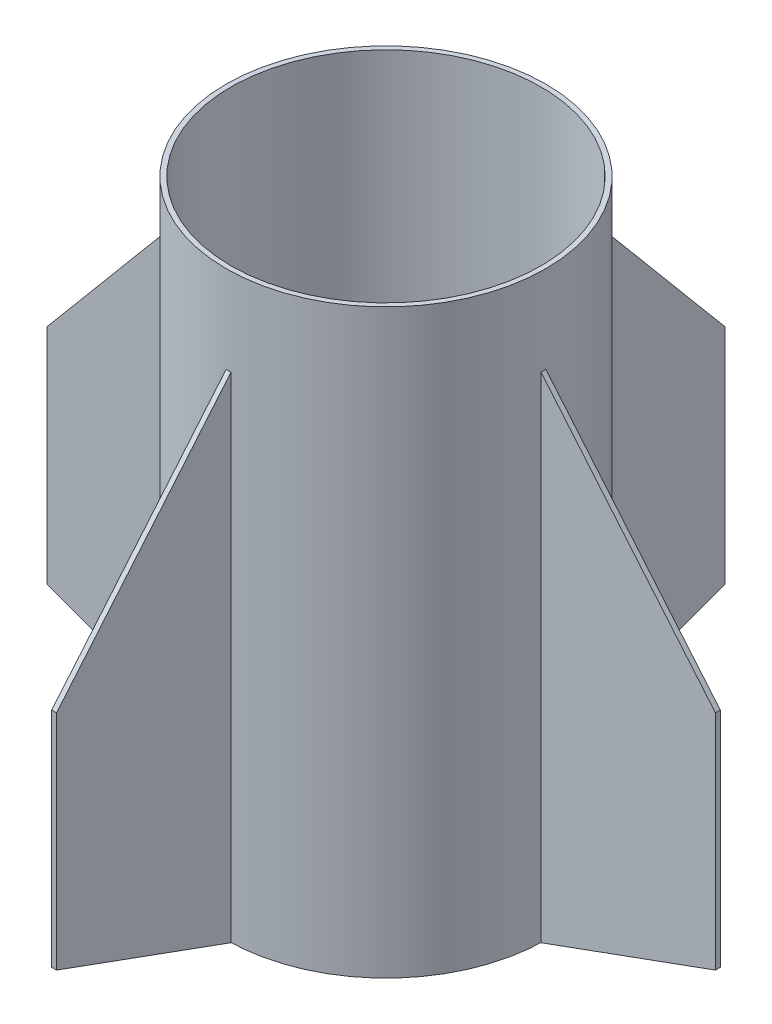
ISO-10303-21;
HEADER;
FILE_DESCRIPTION(('STEP AP214'),'2;1');
FILE_NAME('part.step','',(''),(''),'','','');
FILE_SCHEMA(('AUTOMOTIVE_DESIGN { 1 0 10303 214 1 1 1 1 }'));
ENDSEC;
DATA;
#1=APPLICATION_CONTEXT('core data for automotive mechanical design processes');
#2=APPLICATION_PROTOCOL_DEFINITION('international standard','automotive_design',2000,#1);
#3=PRODUCT_CONTEXT('',#1,'mechanical');
#4=PRODUCT('Part','Part','',(#3));
#5=PRODUCT_RELATED_PRODUCT_CATEGORY('part','',(#4));
#6=PRODUCT_DEFINITION_FORMATION('','',#4);
#7=PRODUCT_DEFINITION_CONTEXT('part definition',#1,'design');
#8=PRODUCT_DEFINITION('design','',#6,#7);
#9=PRODUCT_DEFINITION_SHAPE('','',#8);
#10=(LENGTH_UNIT() NAMED_UNIT(*) SI_UNIT(.MILLI.,.METRE.));
#11=(NAMED_UNIT(*) PLANE_ANGLE_UNIT() SI_UNIT($,.RADIAN.));
#12=(NAMED_UNIT(*) SI_UNIT($,.STERADIAN.) SOLID_ANGLE_UNIT());
#13=UNCERTAINTY_MEASURE_WITH_UNIT(LENGTH_MEASURE(1.E-05),#10,'distance_accuracy_value','');
#14=(GEOMETRIC_REPRESENTATION_CONTEXT(3) GLOBAL_UNCERTAINTY_ASSIGNED_CONTEXT((#13)) GLOBAL_UNIT_ASSIGNED_CONTEXT((#10,
#11,#12)) REPRESENTATION_CONTEXT('',''));
#15=CARTESIAN_POINT('',(0.,0.,0.));
#16=DIRECTION('',(0.,0.,1.));
#17=DIRECTION('',(1.,0.,0.));
#18=AXIS2_PLACEMENT_3D('',#15,#16,#17);
#19=CARTESIAN_POINT('',(104.775,0.,3.175));
#20=DIRECTION('',(1.,0.,0.));
#21=DIRECTION('',(0.,0.,-1.));
#22=AXIS2_PLACEMENT_3D('',#19,#20,#21);
#23=PLANE('',#22);
#24=DIRECTION('',(0.,-1.,0.));
#25=VECTOR('',#24,1.);
#26=CARTESIAN_POINT('',(104.775,0.,0.));
#27=LINE('',#26,#25);
#28=CARTESIAN_POINT('',(104.775,323.85,0.));
#29=VERTEX_POINT('',#28);
#30=CARTESIAN_POINT('',(104.775,0.,0.));
#31=VERTEX_POINT('',#30);
#32=EDGE_CURVE('E107',#29,#31,#27,.T.);
#33=ORIENTED_EDGE('',*,*,#32,.T.);
#34=DIRECTION('',(0.,0.,-1.));
#35=VECTOR('',#34,1.);
#36=CARTESIAN_POINT('',(104.775,0.,3.175));
#37=LINE('',#36,#35);
#38=CARTESIAN_POINT('',(104.775,0.,3.175));
#39=VERTEX_POINT('',#38);
#40=EDGE_CURVE('E12',#39,#31,#37,.T.);
#41=ORIENTED_EDGE('',*,*,#40,.F.);
#42=DIRECTION('',(0.,-1.,0.));
#43=VECTOR('',#42,1.);
#44=CARTESIAN_POINT('',(104.775,0.,3.175));
#45=LINE('',#44,#43);
#46=CARTESIAN_POINT('',(104.775,323.85,3.175));
#47=VERTEX_POINT('',#46);
#48=EDGE_CURVE('E95',#47,#39,#45,.T.);
#49=ORIENTED_EDGE('',*,*,#48,.F.);
#50=DIRECTION('',(0.,0.,-1.));
#51=VECTOR('',#50,1.);
#52=CARTESIAN_POINT('',(104.775,323.85,3.175));
#53=LINE('',#52,#51);
#54=EDGE_CURVE('E103',#47,#29,#53,.T.);
#55=ORIENTED_EDGE('',*,*,#54,.T.);
#56=EDGE_LOOP('',(#33,#41,#49,#55));
#57=FACE_BOUND('',#56,.T.);
#58=ADVANCED_FACE('F44',(#57),#23,.F.);
#59=CARTESIAN_POINT('',(219.075,41.6076727565022,3.175));
#60=DIRECTION('',(-0.342062792128057,0.939677096795254,0.));
#61=DIRECTION('',(-0.939677096795254,-0.342062792128057,0.));
#62=AXIS2_PLACEMENT_3D('',#59,#60,#61);
#63=PLANE('',#62);
#64=DIRECTION('',(0.939677096795254,0.342062792128057,0.));
#65=VECTOR('',#64,1.);
#66=CARTESIAN_POINT('',(219.075,41.6076727565022,0.));
#67=LINE('',#66,#65);
#68=CARTESIAN_POINT('',(219.075,41.6076727565022,0.));
#69=VERTEX_POINT('',#68);
#70=EDGE_CURVE('E99',#31,#69,#67,.T.);
#71=ORIENTED_EDGE('',*,*,#70,.T.);
#72=DIRECTION('',(0.,0.,-1.));
#73=VECTOR('',#72,1.);
#74=CARTESIAN_POINT('',(219.075,41.6076727565022,3.175));
#75=LINE('',#74,#73);
#76=CARTESIAN_POINT('',(219.075,41.6076727565022,3.175));
#77=VERTEX_POINT('',#76);
#78=EDGE_CURVE('E52',#77,#69,#75,.T.);
#79=ORIENTED_EDGE('',*,*,#78,.F.);
#80=DIRECTION('',(0.939677096795254,0.342062792128057,0.));
#81=VECTOR('',#80,1.);
#82=CARTESIAN_POINT('',(219.075,41.6076727565022,3.175));
#83=LINE('',#82,#81);
#84=EDGE_CURVE('E90',#39,#77,#83,.T.);
#85=ORIENTED_EDGE('',*,*,#84,.F.);
#86=ORIENTED_EDGE('',*,*,#40,.T.);
#87=EDGE_LOOP('',(#71,#79,#85,#86));
#88=FACE_BOUND('',#87,.T.);
#89=ADVANCED_FACE('F98',(#88),#63,.F.);
#90=CARTESIAN_POINT('',(219.075,187.657672756502,3.175));
#91=DIRECTION('',(-1.,0.,0.));
#92=DIRECTION('',(0.,-1.,0.));
#93=AXIS2_PLACEMENT_3D('',#90,#91,#92);
#94=PLANE('',#93);
#95=DIRECTION('',(0.,1.,0.));
#96=VECTOR('',#95,1.);
#97=CARTESIAN_POINT('',(219.075,187.657672756502,0.));
#98=LINE('',#97,#96);
#99=CARTESIAN_POINT('',(219.075,187.657672756502,0.));
#100=VERTEX_POINT('',#99);
#101=EDGE_CURVE('E77',#69,#100,#98,.T.);
#102=ORIENTED_EDGE('',*,*,#101,.T.);
#103=DIRECTION('',(0.,0.,-1.));
#104=VECTOR('',#103,1.);
#105=CARTESIAN_POINT('',(219.075,187.657672756502,3.175));
#106=LINE('',#105,#104);
#107=CARTESIAN_POINT('',(219.075,187.657672756502,3.175));
#108=VERTEX_POINT('',#107);
#109=EDGE_CURVE('E100',#108,#100,#106,.T.);
#110=ORIENTED_EDGE('',*,*,#109,.F.);
#111=DIRECTION('',(0.,1.,0.));
#112=VECTOR('',#111,1.);
#113=CARTESIAN_POINT('',(219.075,187.657672756502,3.175));
#114=LINE('',#113,#112);
#115=EDGE_CURVE('E93',#77,#108,#114,.T.);
#116=ORIENTED_EDGE('',*,*,#115,.F.);
#117=ORIENTED_EDGE('',*,*,#78,.T.);
#118=EDGE_LOOP('',(#102,#110,#116,#117));
#119=FACE_BOUND('',#118,.T.);
#120=ADVANCED_FACE('F101',(#119),#94,.F.);
#121=CARTESIAN_POINT('',(104.775,323.85,3.175));
#122=DIRECTION('',(-0.765986092483115,-0.642857142857143,0.));
#123=DIRECTION('',(0.642857142857143,-0.765986092483115,0.));
#124=AXIS2_PLACEMENT_3D('',#121,#122,#123);
#125=PLANE('',#124);
#126=DIRECTION('',(-0.642857142857143,0.765986092483115,0.));
#127=VECTOR('',#126,1.);
#128=CARTESIAN_POINT('',(104.775,323.85,0.));
#129=LINE('',#128,#127);
#130=EDGE_CURVE('E83',#100,#29,#129,.T.);
#131=ORIENTED_EDGE('',*,*,#130,.T.);
#132=ORIENTED_EDGE('',*,*,#54,.F.);
#133=DIRECTION('',(-0.642857142857143,0.765986092483115,0.));
#134=VECTOR('',#133,1.);
#135=CARTESIAN_POINT('',(104.775,323.85,3.175));
#136=LINE('',#135,#134);
#137=EDGE_CURVE('E60',#108,#47,#136,.T.);
#138=ORIENTED_EDGE('',*,*,#137,.F.);
#139=ORIENTED_EDGE('',*,*,#109,.T.);
#140=EDGE_LOOP('',(#131,#132,#138,#139));
#141=FACE_BOUND('',#140,.T.);
#142=ADVANCED_FACE('F114',(#141),#125,.F.);
#143=CARTESIAN_POINT('',(0.,0.,3.175));
#144=DIRECTION('',(0.,0.,1.));
#145=DIRECTION('',(1.,0.,0.));
#146=AXIS2_PLACEMENT_3D('',#143,#144,#145);
#147=PLANE('',#146);
#148=ORIENTED_EDGE('',*,*,#48,.T.);
#149=ORIENTED_EDGE('',*,*,#84,.T.);
#150=ORIENTED_EDGE('',*,*,#115,.T.);
#151=ORIENTED_EDGE('',*,*,#137,.T.);
#152=EDGE_LOOP('',(#148,#149,#150,#151));
#153=FACE_BOUND('',#152,.T.);
#154=ADVANCED_FACE('F91',(#153),#147,.T.);
#155=CARTESIAN_POINT('',(0.,0.,0.));
#156=DIRECTION('',(0.,0.,1.));
#157=DIRECTION('',(1.,0.,0.));
#158=AXIS2_PLACEMENT_3D('',#155,#156,#157);
#159=PLANE('',#158);
#160=ORIENTED_EDGE('',*,*,#32,.F.);
#161=ORIENTED_EDGE('',*,*,#130,.F.);
#162=ORIENTED_EDGE('',*,*,#101,.F.);
#163=ORIENTED_EDGE('',*,*,#70,.F.);
#164=EDGE_LOOP('',(#160,#161,#162,#163));
#165=FACE_BOUND('',#164,.T.);
#166=ADVANCED_FACE('F117',(#165),#159,.F.);
#167=CLOSED_SHELL('',(#58,#89,#120,#142,#154,#166));
#168=MANIFOLD_SOLID_BREP('B2',#167);
#169=CARTESIAN_POINT('',(-104.775,323.85,3.175));
#170=DIRECTION('',(-1.,0.,0.));
#171=DIRECTION('',(0.,0.,1.));
#172=AXIS2_PLACEMENT_3D('',#169,#170,#171);
#173=PLANE('',#172);
#174=DIRECTION('',(0.,1.,0.));
#175=VECTOR('',#174,1.);
#176=CARTESIAN_POINT('',(-104.775,323.85,0.));
#177=LINE('',#176,#175);
#178=CARTESIAN_POINT('',(-104.775,0.,0.));
#179=VERTEX_POINT('',#178);
#180=CARTESIAN_POINT('',(-104.775,323.85,0.));
#181=VERTEX_POINT('',#180);
#182=EDGE_CURVE('E241',#179,#181,#177,.T.);
#183=ORIENTED_EDGE('',*,*,#182,.T.);
#184=DIRECTION('',(0.,0.,-1.));
#185=VECTOR('',#184,1.);
#186=CARTESIAN_POINT('',(-104.775,323.85,3.175));
#187=LINE('',#186,#185);
#188=CARTESIAN_POINT('',(-104.775,323.85,3.175));
#189=VERTEX_POINT('',#188);
#190=EDGE_CURVE('E42',#189,#181,#187,.T.);
#191=ORIENTED_EDGE('',*,*,#190,.F.);
#192=DIRECTION('',(0.,1.,0.));
#193=VECTOR('',#192,1.);
#194=CARTESIAN_POINT('',(-104.775,323.85,3.175));
#195=LINE('',#194,#193);
#196=CARTESIAN_POINT('',(-104.775,0.,3.175));
#197=VERTEX_POINT('',#196);
#198=EDGE_CURVE('E229',#197,#189,#195,.T.);
#199=ORIENTED_EDGE('',*,*,#198,.F.);
#200=DIRECTION('',(0.,0.,-1.));
#201=VECTOR('',#200,1.);
#202=CARTESIAN_POINT('',(-104.775,0.,3.175));
#203=LINE('',#202,#201);
#204=EDGE_CURVE('E237',#197,#179,#203,.T.);
#205=ORIENTED_EDGE('',*,*,#204,.T.);
#206=EDGE_LOOP('',(#183,#191,#199,#205));
#207=FACE_BOUND('',#206,.T.);
#208=ADVANCED_FACE('F178',(#207),#173,.F.);
#209=CARTESIAN_POINT('',(-104.775,323.85,3.175));
#210=DIRECTION('',(0.765986092483115,-0.642857142857143,0.));
#211=DIRECTION('',(0.642857142857143,0.765986092483115,0.));
#212=AXIS2_PLACEMENT_3D('',#209,#210,#211);
#213=PLANE('',#212);
#214=DIRECTION('',(-0.642857142857143,-0.765986092483115,0.));
#215=VECTOR('',#214,1.);
#216=CARTESIAN_POINT('',(-104.775,323.85,0.));
#217=LINE('',#216,#215);
#218=CARTESIAN_POINT('',(-219.075,187.657672756502,0.));
#219=VERTEX_POINT('',#218);
#220=EDGE_CURVE('E233',#181,#219,#217,.T.);
#221=ORIENTED_EDGE('',*,*,#220,.T.);
#222=DIRECTION('',(0.,0.,-1.));
#223=VECTOR('',#222,1.);
#224=CARTESIAN_POINT('',(-219.075,187.657672756502,3.175));
#225=LINE('',#224,#223);
#226=CARTESIAN_POINT('',(-219.075,187.657672756502,3.175));
#227=VERTEX_POINT('',#226);
#228=EDGE_CURVE('E186',#227,#219,#225,.T.);
#229=ORIENTED_EDGE('',*,*,#228,.F.);
#230=DIRECTION('',(-0.642857142857143,-0.765986092483115,0.));
#231=VECTOR('',#230,1.);
#232=CARTESIAN_POINT('',(-104.775,323.85,3.175));
#233=LINE('',#232,#231);
#234=EDGE_CURVE('E224',#189,#227,#233,.T.);
#235=ORIENTED_EDGE('',*,*,#234,.F.);
#236=ORIENTED_EDGE('',*,*,#190,.T.);
#237=EDGE_LOOP('',(#221,#229,#235,#236));
#238=FACE_BOUND('',#237,.T.);
#239=ADVANCED_FACE('F232',(#238),#213,.F.);
#240=CARTESIAN_POINT('',(-219.075,187.657672756502,3.175));
#241=DIRECTION('',(1.,0.,0.));
#242=DIRECTION('',(0.,1.,0.));
#243=AXIS2_PLACEMENT_3D('',#240,#241,#242);
#244=PLANE('',#243);
#245=DIRECTION('',(0.,-1.,0.));
#246=VECTOR('',#245,1.);
#247=CARTESIAN_POINT('',(-219.075,187.657672756502,0.));
#248=LINE('',#247,#246);
#249=CARTESIAN_POINT('',(-219.075,41.6076727565021,0.));
#250=VERTEX_POINT('',#249);
#251=EDGE_CURVE('E211',#219,#250,#248,.T.);
#252=ORIENTED_EDGE('',*,*,#251,.T.);
#253=DIRECTION('',(0.,0.,-1.));
#254=VECTOR('',#253,1.);
#255=CARTESIAN_POINT('',(-219.075,41.6076727565021,3.175));
#256=LINE('',#255,#254);
#257=CARTESIAN_POINT('',(-219.075,41.6076727565021,3.175));
#258=VERTEX_POINT('',#257);
#259=EDGE_CURVE('E234',#258,#250,#256,.T.);
#260=ORIENTED_EDGE('',*,*,#259,.F.);
#261=DIRECTION('',(0.,-1.,0.));
#262=VECTOR('',#261,1.);
#263=CARTESIAN_POINT('',(-219.075,187.657672756502,3.175));
#264=LINE('',#263,#262);
#265=EDGE_CURVE('E227',#227,#258,#264,.T.);
#266=ORIENTED_EDGE('',*,*,#265,.F.);
#267=ORIENTED_EDGE('',*,*,#228,.T.);
#268=EDGE_LOOP('',(#252,#260,#266,#267));
#269=FACE_BOUND('',#268,.T.);
#270=ADVANCED_FACE('F235',(#269),#244,.F.);
#271=CARTESIAN_POINT('',(-219.075,41.6076727565021,3.175));
#272=DIRECTION('',(0.342062792128057,0.939677096795254,0.));
#273=DIRECTION('',(-0.939677096795254,0.342062792128057,0.));
#274=AXIS2_PLACEMENT_3D('',#271,#272,#273);
#275=PLANE('',#274);
#276=DIRECTION('',(0.939677096795254,-0.342062792128057,0.));
#277=VECTOR('',#276,1.);
#278=CARTESIAN_POINT('',(-219.075,41.6076727565021,0.));
#279=LINE('',#278,#277);
#280=EDGE_CURVE('E217',#250,#179,#279,.T.);
#281=ORIENTED_EDGE('',*,*,#280,.T.);
#282=ORIENTED_EDGE('',*,*,#204,.F.);
#283=DIRECTION('',(0.939677096795254,-0.342062792128057,0.));
#284=VECTOR('',#283,1.);
#285=CARTESIAN_POINT('',(-219.075,41.6076727565021,3.175));
#286=LINE('',#285,#284);
#287=EDGE_CURVE('E194',#258,#197,#286,.T.);
#288=ORIENTED_EDGE('',*,*,#287,.F.);
#289=ORIENTED_EDGE('',*,*,#259,.T.);
#290=EDGE_LOOP('',(#281,#282,#288,#289));
#291=FACE_BOUND('',#290,.T.);
#292=ADVANCED_FACE('F248',(#291),#275,.F.);
#293=CARTESIAN_POINT('',(0.,0.,3.175));
#294=DIRECTION('',(0.,0.,1.));
#295=DIRECTION('',(1.,0.,0.));
#296=AXIS2_PLACEMENT_3D('',#293,#294,#295);
#297=PLANE('',#296);
#298=ORIENTED_EDGE('',*,*,#198,.T.);
#299=ORIENTED_EDGE('',*,*,#234,.T.);
#300=ORIENTED_EDGE('',*,*,#265,.T.);
#301=ORIENTED_EDGE('',*,*,#287,.T.);
#302=EDGE_LOOP('',(#298,#299,#300,#301));
#303=FACE_BOUND('',#302,.T.);
#304=ADVANCED_FACE('F225',(#303),#297,.T.);
#305=CARTESIAN_POINT('',(0.,0.,0.));
#306=DIRECTION('',(0.,0.,1.));
#307=DIRECTION('',(1.,0.,0.));
#308=AXIS2_PLACEMENT_3D('',#305,#306,#307);
#309=PLANE('',#308);
#310=ORIENTED_EDGE('',*,*,#182,.F.);
#311=ORIENTED_EDGE('',*,*,#280,.F.);
#312=ORIENTED_EDGE('',*,*,#251,.F.);
#313=ORIENTED_EDGE('',*,*,#220,.F.);
#314=EDGE_LOOP('',(#310,#311,#312,#313));
#315=FACE_BOUND('',#314,.T.);
#316=ADVANCED_FACE('F251',(#315),#309,.F.);
#317=CLOSED_SHELL('',(#208,#239,#270,#292,#304,#316));
#318=MANIFOLD_SOLID_BREP('B6',#317);
#319=CARTESIAN_POINT('',(3.175,323.85,-104.775));
#320=DIRECTION('',(0.,0.,-1.));
#321=DIRECTION('',(-1.,0.,0.));
#322=AXIS2_PLACEMENT_3D('',#319,#320,#321);
#323=PLANE('',#322);
#324=DIRECTION('',(0.,-1.,0.));
#325=VECTOR('',#324,1.);
#326=CARTESIAN_POINT('',(0.,323.85,-104.775));
#327=LINE('',#326,#325);
#328=CARTESIAN_POINT('',(0.,323.85,-104.775));
#329=VERTEX_POINT('',#328);
#330=CARTESIAN_POINT('',(0.,0.,-104.775));
#331=VERTEX_POINT('',#330);
#332=EDGE_CURVE('E375',#329,#331,#327,.T.);
#333=ORIENTED_EDGE('',*,*,#332,.T.);
#334=DIRECTION('',(-1.,0.,0.));
#335=VECTOR('',#334,1.);
#336=CARTESIAN_POINT('',(3.175,0.,-104.775));
#337=LINE('',#336,#335);
#338=CARTESIAN_POINT('',(3.175,0.,-104.775));
#339=VERTEX_POINT('',#338);
#340=EDGE_CURVE('E176',#339,#331,#337,.T.);
#341=ORIENTED_EDGE('',*,*,#340,.F.);
#342=DIRECTION('',(0.,-1.,0.));
#343=VECTOR('',#342,1.);
#344=CARTESIAN_POINT('',(3.175,323.85,-104.775));
#345=LINE('',#344,#343);
#346=CARTESIAN_POINT('',(3.175,323.85,-104.775));
#347=VERTEX_POINT('',#346);
#348=EDGE_CURVE('E363',#347,#339,#345,.T.);
#349=ORIENTED_EDGE('',*,*,#348,.F.);
#350=DIRECTION('',(-1.,0.,0.));
#351=VECTOR('',#350,1.);
#352=CARTESIAN_POINT('',(3.175,323.85,-104.775));
#353=LINE('',#352,#351);
#354=EDGE_CURVE('E371',#347,#329,#353,.T.);
#355=ORIENTED_EDGE('',*,*,#354,.T.);
#356=EDGE_LOOP('',(#333,#341,#349,#355));
#357=FACE_BOUND('',#356,.T.);
#358=ADVANCED_FACE('F312',(#357),#323,.F.);
#359=CARTESIAN_POINT('',(3.175,41.6076727565022,-219.075));
#360=DIRECTION('',(0.,0.939677096795254,0.342062792128058));
#361=DIRECTION('',(0.,-0.342062792128058,0.939677096795254));
#362=AXIS2_PLACEMENT_3D('',#359,#360,#361);
#363=PLANE('',#362);
#364=DIRECTION('',(0.,0.342062792128058,-0.939677096795254));
#365=VECTOR('',#364,1.);
#366=CARTESIAN_POINT('',(0.,41.6076727565022,-219.075));
#367=LINE('',#366,#365);
#368=CARTESIAN_POINT('',(0.,41.6076727565022,-219.075));
#369=VERTEX_POINT('',#368);
#370=EDGE_CURVE('E367',#331,#369,#367,.T.);
#371=ORIENTED_EDGE('',*,*,#370,.T.);
#372=DIRECTION('',(-1.,0.,0.));
#373=VECTOR('',#372,1.);
#374=CARTESIAN_POINT('',(3.175,41.6076727565022,-219.075));
#375=LINE('',#374,#373);
#376=CARTESIAN_POINT('',(3.175,41.6076727565022,-219.075));
#377=VERTEX_POINT('',#376);
#378=EDGE_CURVE('E320',#377,#369,#375,.T.);
#379=ORIENTED_EDGE('',*,*,#378,.F.);
#380=DIRECTION('',(0.,0.342062792128058,-0.939677096795254));
#381=VECTOR('',#380,1.);
#382=CARTESIAN_POINT('',(3.175,41.6076727565022,-219.075));
#383=LINE('',#382,#381);
#384=EDGE_CURVE('E358',#339,#377,#383,.T.);
#385=ORIENTED_EDGE('',*,*,#384,.F.);
#386=ORIENTED_EDGE('',*,*,#340,.T.);
#387=EDGE_LOOP('',(#371,#379,#385,#386));
#388=FACE_BOUND('',#387,.T.);
#389=ADVANCED_FACE('F366',(#388),#363,.F.);
#390=CARTESIAN_POINT('',(3.175,187.657672756502,-219.075));
#391=DIRECTION('',(0.,0.,1.));
#392=DIRECTION('',(1.,0.,0.));
#393=AXIS2_PLACEMENT_3D('',#390,#391,#392);
#394=PLANE('',#393);
#395=DIRECTION('',(0.,1.,0.));
#396=VECTOR('',#395,1.);
#397=CARTESIAN_POINT('',(0.,187.657672756502,-219.075));
#398=LINE('',#397,#396);
#399=CARTESIAN_POINT('',(0.,187.657672756502,-219.075));
#400=VERTEX_POINT('',#399);
#401=EDGE_CURVE('E345',#369,#400,#398,.T.);
#402=ORIENTED_EDGE('',*,*,#401,.T.);
#403=DIRECTION('',(-1.,0.,0.));
#404=VECTOR('',#403,1.);
#405=CARTESIAN_POINT('',(3.175,187.657672756502,-219.075));
#406=LINE('',#405,#404);
#407=CARTESIAN_POINT('',(3.175,187.657672756502,-219.075));
#408=VERTEX_POINT('',#407);
#409=EDGE_CURVE('E368',#408,#400,#406,.T.);
#410=ORIENTED_EDGE('',*,*,#409,.F.);
#411=DIRECTION('',(0.,1.,0.));
#412=VECTOR('',#411,1.);
#413=CARTESIAN_POINT('',(3.175,187.657672756502,-219.075));
#414=LINE('',#413,#412);
#415=EDGE_CURVE('E361',#377,#408,#414,.T.);
#416=ORIENTED_EDGE('',*,*,#415,.F.);
#417=ORIENTED_EDGE('',*,*,#378,.T.);
#418=EDGE_LOOP('',(#402,#410,#416,#417));
#419=FACE_BOUND('',#418,.T.);
#420=ADVANCED_FACE('F369',(#419),#394,.F.);
#421=CARTESIAN_POINT('',(3.175,323.85,-104.775));
#422=DIRECTION('',(0.,-0.642857142857143,0.765986092483115));
#423=DIRECTION('',(0.,-0.765986092483115,-0.642857142857143));
#424=AXIS2_PLACEMENT_3D('',#421,#422,#423);
#425=PLANE('',#424);
#426=DIRECTION('',(0.,0.765986092483115,0.642857142857143));
#427=VECTOR('',#426,1.);
#428=CARTESIAN_POINT('',(0.,323.85,-104.775));
#429=LINE('',#428,#427);
#430=EDGE_CURVE('E351',#400,#329,#429,.T.);
#431=ORIENTED_EDGE('',*,*,#430,.T.);
#432=ORIENTED_EDGE('',*,*,#354,.F.);
#433=DIRECTION('',(0.,0.765986092483115,0.642857142857143));
#434=VECTOR('',#433,1.);
#435=CARTESIAN_POINT('',(3.175,323.85,-104.775));
#436=LINE('',#435,#434);
#437=EDGE_CURVE('E328',#408,#347,#436,.T.);
#438=ORIENTED_EDGE('',*,*,#437,.F.);
#439=ORIENTED_EDGE('',*,*,#409,.T.);
#440=EDGE_LOOP('',(#431,#432,#438,#439));
#441=FACE_BOUND('',#440,.T.);
#442=ADVANCED_FACE('F382',(#441),#425,.F.);
#443=CARTESIAN_POINT('',(3.175,0.,0.));
#444=DIRECTION('',(-1.,0.,0.));
#445=DIRECTION('',(0.,0.,1.));
#446=AXIS2_PLACEMENT_3D('',#443,#444,#445);
#447=PLANE('',#446);
#448=ORIENTED_EDGE('',*,*,#348,.T.);
#449=ORIENTED_EDGE('',*,*,#384,.T.);
#450=ORIENTED_EDGE('',*,*,#415,.T.);
#451=ORIENTED_EDGE('',*,*,#437,.T.);
#452=EDGE_LOOP('',(#448,#449,#450,#451));
#453=FACE_BOUND('',#452,.T.);
#454=ADVANCED_FACE('F359',(#453),#447,.F.);
#455=CARTESIAN_POINT('',(0.,0.,0.));
#456=DIRECTION('',(-1.,0.,0.));
#457=DIRECTION('',(0.,0.,1.));
#458=AXIS2_PLACEMENT_3D('',#455,#456,#457);
#459=PLANE('',#458);
#460=ORIENTED_EDGE('',*,*,#332,.F.);
#461=ORIENTED_EDGE('',*,*,#430,.F.);
#462=ORIENTED_EDGE('',*,*,#401,.F.);
#463=ORIENTED_EDGE('',*,*,#370,.F.);
#464=EDGE_LOOP('',(#460,#461,#462,#463));
#465=FACE_BOUND('',#464,.T.);
#466=ADVANCED_FACE('F385',(#465),#459,.T.);
#467=CLOSED_SHELL('',(#358,#389,#420,#442,#454,#466));
#468=MANIFOLD_SOLID_BREP('B36',#467);
#469=CARTESIAN_POINT('',(3.175,0.,104.775));
#470=DIRECTION('',(0.,0.,1.));
#471=DIRECTION('',(1.,0.,0.));
#472=AXIS2_PLACEMENT_3D('',#469,#470,#471);
#473=PLANE('',#472);
#474=DIRECTION('',(0.,1.,0.));
#475=VECTOR('',#474,1.);
#476=CARTESIAN_POINT('',(0.,0.,104.775));
#477=LINE('',#476,#475);
#478=CARTESIAN_POINT('',(0.,0.,104.775));
#479=VERTEX_POINT('',#478);
#480=CARTESIAN_POINT('',(0.,323.85,104.775));
#481=VERTEX_POINT('',#480);
#482=EDGE_CURVE('E506',#479,#481,#477,.T.);
#483=ORIENTED_EDGE('',*,*,#482,.T.);
#484=DIRECTION('',(-1.,0.,0.));
#485=VECTOR('',#484,1.);
#486=CARTESIAN_POINT('',(3.175,323.85,104.775));
#487=LINE('',#486,#485);
#488=CARTESIAN_POINT('',(3.175,323.85,104.775));
#489=VERTEX_POINT('',#488);
#490=EDGE_CURVE('E310',#489,#481,#487,.T.);
#491=ORIENTED_EDGE('',*,*,#490,.F.);
#492=DIRECTION('',(0.,1.,0.));
#493=VECTOR('',#492,1.);
#494=CARTESIAN_POINT('',(3.175,0.,104.775));
#495=LINE('',#494,#493);
#496=CARTESIAN_POINT('',(3.175,0.,104.775));
#497=VERTEX_POINT('',#496);
#498=EDGE_CURVE('E494',#497,#489,#495,.T.);
#499=ORIENTED_EDGE('',*,*,#498,.F.);
#500=DIRECTION('',(-1.,0.,0.));
#501=VECTOR('',#500,1.);
#502=CARTESIAN_POINT('',(3.175,0.,104.775));
#503=LINE('',#502,#501);
#504=EDGE_CURVE('E502',#497,#479,#503,.T.);
#505=ORIENTED_EDGE('',*,*,#504,.T.);
#506=EDGE_LOOP('',(#483,#491,#499,#505));
#507=FACE_BOUND('',#506,.T.);
#508=ADVANCED_FACE('F443',(#507),#473,.F.);
#509=CARTESIAN_POINT('',(3.175,323.85,104.775));
#510=DIRECTION('',(0.,-0.642857142857143,-0.765986092483115));
#511=DIRECTION('',(0.,0.765986092483115,-0.642857142857143));
#512=AXIS2_PLACEMENT_3D('',#509,#510,#511);
#513=PLANE('',#512);
#514=DIRECTION('',(0.,-0.765986092483115,0.642857142857143));
#515=VECTOR('',#514,1.);
#516=CARTESIAN_POINT('',(0.,323.85,104.775));
#517=LINE('',#516,#515);
#518=CARTESIAN_POINT('',(0.,187.657672756502,219.075));
#519=VERTEX_POINT('',#518);
#520=EDGE_CURVE('E498',#481,#519,#517,.T.);
#521=ORIENTED_EDGE('',*,*,#520,.T.);
#522=DIRECTION('',(-1.,0.,0.));
#523=VECTOR('',#522,1.);
#524=CARTESIAN_POINT('',(3.175,187.657672756502,219.075));
#525=LINE('',#524,#523);
#526=CARTESIAN_POINT('',(3.175,187.657672756502,219.075));
#527=VERTEX_POINT('',#526);
#528=EDGE_CURVE('E451',#527,#519,#525,.T.);
#529=ORIENTED_EDGE('',*,*,#528,.F.);
#530=DIRECTION('',(0.,-0.765986092483115,0.642857142857143));
#531=VECTOR('',#530,1.);
#532=CARTESIAN_POINT('',(3.175,323.85,104.775));
#533=LINE('',#532,#531);
#534=EDGE_CURVE('E489',#489,#527,#533,.T.);
#535=ORIENTED_EDGE('',*,*,#534,.F.);
#536=ORIENTED_EDGE('',*,*,#490,.T.);
#537=EDGE_LOOP('',(#521,#529,#535,#536));
#538=FACE_BOUND('',#537,.T.);
#539=ADVANCED_FACE('F497',(#538),#513,.F.);
#540=CARTESIAN_POINT('',(3.175,187.657672756502,219.075));
#541=DIRECTION('',(0.,0.,-1.));
#542=DIRECTION('',(0.,1.,0.));
#543=AXIS2_PLACEMENT_3D('',#540,#541,#542);
#544=PLANE('',#543);
#545=DIRECTION('',(0.,-1.,0.));
#546=VECTOR('',#545,1.);
#547=CARTESIAN_POINT('',(0.,187.657672756502,219.075));
#548=LINE('',#547,#546);
#549=CARTESIAN_POINT('',(0.,41.6076727565022,219.075));
#550=VERTEX_POINT('',#549);
#551=EDGE_CURVE('E476',#519,#550,#548,.T.);
#552=ORIENTED_EDGE('',*,*,#551,.T.);
#553=DIRECTION('',(-1.,0.,0.));
#554=VECTOR('',#553,1.);
#555=CARTESIAN_POINT('',(3.175,41.6076727565022,219.075));
#556=LINE('',#555,#554);
#557=CARTESIAN_POINT('',(3.175,41.6076727565022,219.075));
#558=VERTEX_POINT('',#557);
#559=EDGE_CURVE('E499',#558,#550,#556,.T.);
#560=ORIENTED_EDGE('',*,*,#559,.F.);
#561=DIRECTION('',(0.,-1.,0.));
#562=VECTOR('',#561,1.);
#563=CARTESIAN_POINT('',(3.175,187.657672756502,219.075));
#564=LINE('',#563,#562);
#565=EDGE_CURVE('E492',#527,#558,#564,.T.);
#566=ORIENTED_EDGE('',*,*,#565,.F.);
#567=ORIENTED_EDGE('',*,*,#528,.T.);
#568=EDGE_LOOP('',(#552,#560,#566,#567));
#569=FACE_BOUND('',#568,.T.);
#570=ADVANCED_FACE('F500',(#569),#544,.F.);
#571=CARTESIAN_POINT('',(3.175,41.6076727565022,219.075));
#572=DIRECTION('',(0.,0.939677096795254,-0.342062792128057));
#573=DIRECTION('',(0.,0.342062792128057,0.939677096795254));
#574=AXIS2_PLACEMENT_3D('',#571,#572,#573);
#575=PLANE('',#574);
#576=DIRECTION('',(0.,-0.342062792128057,-0.939677096795254));
#577=VECTOR('',#576,1.);
#578=CARTESIAN_POINT('',(0.,41.6076727565022,219.075));
#579=LINE('',#578,#577);
#580=EDGE_CURVE('E482',#550,#479,#579,.T.);
#581=ORIENTED_EDGE('',*,*,#580,.T.);
#582=ORIENTED_EDGE('',*,*,#504,.F.);
#583=DIRECTION('',(0.,-0.342062792128057,-0.939677096795254));
#584=VECTOR('',#583,1.);
#585=CARTESIAN_POINT('',(3.175,41.6076727565022,219.075));
#586=LINE('',#585,#584);
#587=EDGE_CURVE('E459',#558,#497,#586,.T.);
#588=ORIENTED_EDGE('',*,*,#587,.F.);
#589=ORIENTED_EDGE('',*,*,#559,.T.);
#590=EDGE_LOOP('',(#581,#582,#588,#589));
#591=FACE_BOUND('',#590,.T.);
#592=ADVANCED_FACE('F513',(#591),#575,.F.);
#593=CARTESIAN_POINT('',(3.175,0.,0.));
#594=DIRECTION('',(-1.,0.,0.));
#595=DIRECTION('',(0.,0.,1.));
#596=AXIS2_PLACEMENT_3D('',#593,#594,#595);
#597=PLANE('',#596);
#598=ORIENTED_EDGE('',*,*,#498,.T.);
#599=ORIENTED_EDGE('',*,*,#534,.T.);
#600=ORIENTED_EDGE('',*,*,#565,.T.);
#601=ORIENTED_EDGE('',*,*,#587,.T.);
#602=EDGE_LOOP('',(#598,#599,#600,#601));
#603=FACE_BOUND('',#602,.T.);
#604=ADVANCED_FACE('F490',(#603),#597,.F.);
#605=CARTESIAN_POINT('',(0.,0.,0.));
#606=DIRECTION('',(-1.,0.,0.));
#607=DIRECTION('',(0.,0.,1.));
#608=AXIS2_PLACEMENT_3D('',#605,#606,#607);
#609=PLANE('',#608);
#610=ORIENTED_EDGE('',*,*,#482,.F.);
#611=ORIENTED_EDGE('',*,*,#580,.F.);
#612=ORIENTED_EDGE('',*,*,#551,.F.);
#613=ORIENTED_EDGE('',*,*,#520,.F.);
#614=EDGE_LOOP('',(#610,#611,#612,#613));
#615=FACE_BOUND('',#614,.T.);
#616=ADVANCED_FACE('F516',(#615),#609,.T.);
#617=CLOSED_SHELL('',(#508,#539,#570,#592,#604,#616));
#618=MANIFOLD_SOLID_BREP('B170',#617);
#619=CARTESIAN_POINT('',(0.,381.,0.));
#620=DIRECTION('',(0.,1.,0.));
#621=DIRECTION('',(0.,0.,1.));
#622=AXIS2_PLACEMENT_3D('',#619,#620,#621);
#623=PLANE('',#622);
#624=CARTESIAN_POINT('',(0.,381.,0.));
#625=DIRECTION('',(0.,1.,0.));
#626=DIRECTION('',(0.,0.,1.));
#627=AXIS2_PLACEMENT_3D('',#624,#625,#626);
#628=CIRCLE('',#627,104.775);
#629=CARTESIAN_POINT('',(0.,381.,104.775));
#630=VERTEX_POINT('',#629);
#631=EDGE_CURVE('E442',#630,#630,#628,.T.);
#632=ORIENTED_EDGE('',*,*,#631,.T.);
#633=EDGE_LOOP('',(#632));
#634=FACE_BOUND('',#633,.T.);
#635=CARTESIAN_POINT('',(0.,381.,0.));
#636=DIRECTION('',(0.,1.,0.));
#637=DIRECTION('',(0.,0.,1.));
#638=AXIS2_PLACEMENT_3D('',#635,#636,#637);
#639=CIRCLE('',#638,101.6);
#640=CARTESIAN_POINT('',(0.,381.,101.6));
#641=VERTEX_POINT('',#640);
#642=EDGE_CURVE('E578',#641,#641,#639,.T.);
#643=ORIENTED_EDGE('',*,*,#642,.F.);
#644=EDGE_LOOP('',(#643));
#645=FACE_BOUND('',#644,.T.);
#646=ADVANCED_FACE('F567',(#634,#645),#623,.T.);
#647=CARTESIAN_POINT('',(0.,0.,0.));
#648=DIRECTION('',(0.,1.,0.));
#649=DIRECTION('',(0.,0.,1.));
#650=AXIS2_PLACEMENT_3D('',#647,#648,#649);
#651=PLANE('',#650);
#652=CARTESIAN_POINT('',(0.,0.,0.));
#653=DIRECTION('',(0.,1.,0.));
#654=DIRECTION('',(0.,0.,1.));
#655=AXIS2_PLACEMENT_3D('',#652,#653,#654);
#656=CIRCLE('',#655,104.775);
#657=CARTESIAN_POINT('',(0.,0.,104.775));
#658=VERTEX_POINT('',#657);
#659=EDGE_CURVE('E571',#658,#658,#656,.T.);
#660=ORIENTED_EDGE('',*,*,#659,.F.);
#661=EDGE_LOOP('',(#660));
#662=FACE_BOUND('',#661,.T.);
#663=CARTESIAN_POINT('',(0.,0.,0.));
#664=DIRECTION('',(0.,1.,0.));
#665=DIRECTION('',(0.,0.,1.));
#666=AXIS2_PLACEMENT_3D('',#663,#664,#665);
#667=CIRCLE('',#666,101.6);
#668=CARTESIAN_POINT('',(0.,0.,101.6));
#669=VERTEX_POINT('',#668);
#670=EDGE_CURVE('E580',#669,#669,#667,.T.);
#671=ORIENTED_EDGE('',*,*,#670,.T.);
#672=EDGE_LOOP('',(#671));
#673=FACE_BOUND('',#672,.T.);
#674=ADVANCED_FACE('F590',(#662,#673),#651,.F.);
#675=CARTESIAN_POINT('',(0.,381.,0.));
#676=DIRECTION('',(0.,-1.,0.));
#677=DIRECTION('',(0.,0.,-1.));
#678=AXIS2_PLACEMENT_3D('',#675,#676,#677);
#679=CYLINDRICAL_SURFACE('',#678,104.775);
#680=ORIENTED_EDGE('',*,*,#631,.F.);
#681=EDGE_LOOP('',(#680));
#682=FACE_BOUND('',#681,.T.);
#683=ORIENTED_EDGE('',*,*,#659,.T.);
#684=EDGE_LOOP('',(#683));
#685=FACE_BOUND('',#684,.T.);
#686=ADVANCED_FACE('F569',(#682,#685),#679,.T.);
#687=CARTESIAN_POINT('',(0.,381.,0.));
#688=DIRECTION('',(0.,-1.,0.));
#689=DIRECTION('',(0.,0.,-1.));
#690=AXIS2_PLACEMENT_3D('',#687,#688,#689);
#691=CYLINDRICAL_SURFACE('',#690,101.6);
#692=ORIENTED_EDGE('',*,*,#642,.T.);
#693=EDGE_LOOP('',(#692));
#694=FACE_BOUND('',#693,.T.);
#695=ORIENTED_EDGE('',*,*,#670,.F.);
#696=EDGE_LOOP('',(#695));
#697=FACE_BOUND('',#696,.T.);
#698=ADVANCED_FACE('F586',(#694,#697),#691,.F.);
#699=CLOSED_SHELL('',(#646,#674,#686,#698));
#700=MANIFOLD_SOLID_BREP('B304',#699);
#701=ADVANCED_BREP_SHAPE_REPRESENTATION('',(#18,#168,#318,#468,#618,#700),#14);
#702=SHAPE_DEFINITION_REPRESENTATION(#9,#701);
ENDSEC;
END-ISO-10303-21;
